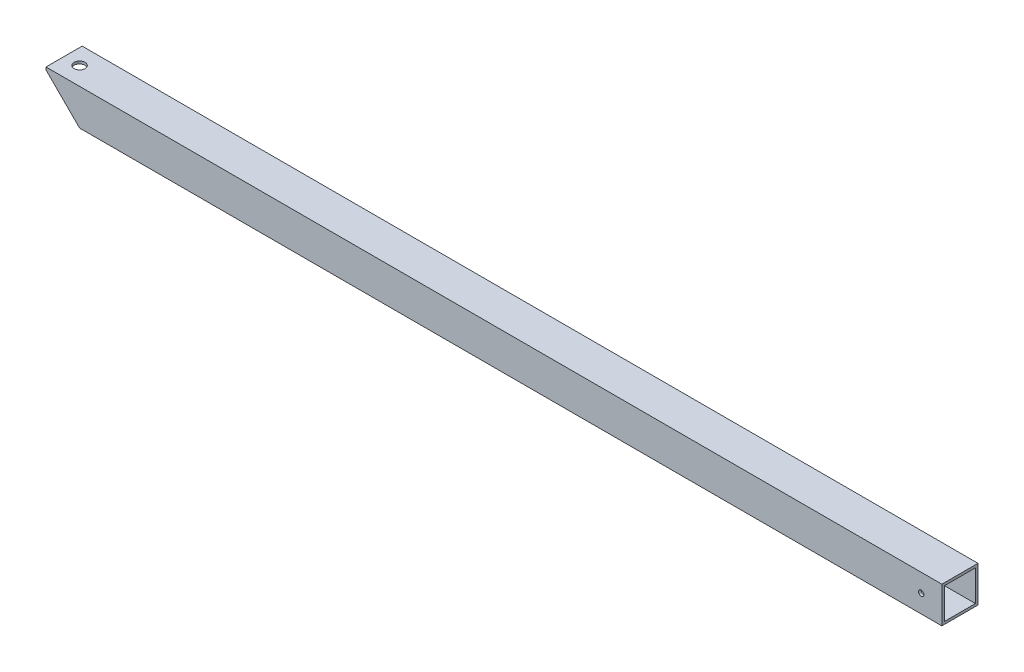
ISO-10303-21;
HEADER;
FILE_DESCRIPTION(('STEP AP214'),'2;1');
FILE_NAME('part.step','',(''),(''),'','','');
FILE_SCHEMA(('AUTOMOTIVE_DESIGN { 1 0 10303 214 1 1 1 1 }'));
ENDSEC;
DATA;
#1=APPLICATION_CONTEXT('core data for automotive mechanical design processes');
#2=APPLICATION_PROTOCOL_DEFINITION('international standard','automotive_design',2000,#1);
#3=PRODUCT_CONTEXT('',#1,'mechanical');
#4=PRODUCT('Part','Part','',(#3));
#5=PRODUCT_RELATED_PRODUCT_CATEGORY('part','',(#4));
#6=PRODUCT_DEFINITION_FORMATION('','',#4);
#7=PRODUCT_DEFINITION_CONTEXT('part definition',#1,'design');
#8=PRODUCT_DEFINITION('design','',#6,#7);
#9=PRODUCT_DEFINITION_SHAPE('','',#8);
#10=(LENGTH_UNIT() NAMED_UNIT(*) SI_UNIT(.MILLI.,.METRE.));
#11=(NAMED_UNIT(*) PLANE_ANGLE_UNIT() SI_UNIT($,.RADIAN.));
#12=(NAMED_UNIT(*) SI_UNIT($,.STERADIAN.) SOLID_ANGLE_UNIT());
#13=UNCERTAINTY_MEASURE_WITH_UNIT(LENGTH_MEASURE(1.E-05),#10,'distance_accuracy_value','');
#14=(GEOMETRIC_REPRESENTATION_CONTEXT(3) GLOBAL_UNCERTAINTY_ASSIGNED_CONTEXT((#13)) GLOBAL_UNIT_ASSIGNED_CONTEXT((#10,
#11,#12)) REPRESENTATION_CONTEXT('',''));
#15=CARTESIAN_POINT('',(0.,0.,0.));
#16=DIRECTION('',(0.,0.,1.));
#17=DIRECTION('',(1.,0.,0.));
#18=AXIS2_PLACEMENT_3D('',#15,#16,#17);
#19=CARTESIAN_POINT('',(0.,-3.175,22.225));
#20=DIRECTION('',(0.707106781186549,0.707106781186546,0.));
#21=DIRECTION('',(-0.707106781186546,0.707106781186549,0.));
#22=AXIS2_PLACEMENT_3D('',#19,#20,#21);
#23=PLANE('',#22);
#24=DIRECTION('',(0.707106781186546,-0.707106781186549,0.));
#25=VECTOR('',#24,1.);
#26=CARTESIAN_POINT('',(0.,-3.175,-19.05));
#27=LINE('',#26,#25);
#28=CARTESIAN_POINT('',(0.,-3.175,-19.05));
#29=VERTEX_POINT('',#28);
#30=CARTESIAN_POINT('',(38.0999999999999,-41.275,-19.05));
#31=VERTEX_POINT('',#30);
#32=EDGE_CURVE('E111',#29,#31,#27,.T.);
#33=ORIENTED_EDGE('',*,*,#32,.F.);
#34=DIRECTION('',(0.,0.,-1.));
#35=VECTOR('',#34,1.);
#36=CARTESIAN_POINT('',(0.,-3.175,22.225));
#37=LINE('',#36,#35);
#38=CARTESIAN_POINT('',(0.,-3.175,-22.225));
#39=VERTEX_POINT('',#38);
#40=EDGE_CURVE('E43',#29,#39,#37,.T.);
#41=ORIENTED_EDGE('',*,*,#40,.T.);
#42=DIRECTION('',(0.707106781186546,-0.707106781186549,0.));
#43=VECTOR('',#42,1.);
#44=CARTESIAN_POINT('',(0.,-3.175,-22.225));
#45=LINE('',#44,#43);
#46=CARTESIAN_POINT('',(41.2749999999998,-44.45,-22.225));
#47=VERTEX_POINT('',#46);
#48=EDGE_CURVE('E158',#39,#47,#45,.T.);
#49=ORIENTED_EDGE('',*,*,#48,.T.);
#50=DIRECTION('',(0.,0.,-1.));
#51=VECTOR('',#50,1.);
#52=CARTESIAN_POINT('',(41.2749999999998,-44.45,22.225));
#53=LINE('',#52,#51);
#54=CARTESIAN_POINT('',(41.2749999999998,-44.45,22.225));
#55=VERTEX_POINT('',#54);
#56=EDGE_CURVE('E138',#55,#47,#53,.T.);
#57=ORIENTED_EDGE('',*,*,#56,.F.);
#58=DIRECTION('',(0.707106781186546,-0.707106781186549,0.));
#59=VECTOR('',#58,1.);
#60=CARTESIAN_POINT('',(0.,-3.175,22.225));
#61=LINE('',#60,#59);
#62=CARTESIAN_POINT('',(0.,-3.175,22.225));
#63=VERTEX_POINT('',#62);
#64=EDGE_CURVE('E167',#63,#55,#61,.T.);
#65=ORIENTED_EDGE('',*,*,#64,.F.);
#66=CARTESIAN_POINT('',(0.,-3.175,19.05));
#67=VERTEX_POINT('',#66);
#68=EDGE_CURVE('E11',#63,#67,#37,.T.);
#69=ORIENTED_EDGE('',*,*,#68,.T.);
#70=DIRECTION('',(0.707106781186546,-0.707106781186549,0.));
#71=VECTOR('',#70,1.);
#72=CARTESIAN_POINT('',(0.,-3.175,19.05));
#73=LINE('',#72,#71);
#74=CARTESIAN_POINT('',(38.0999999999999,-41.275,19.05));
#75=VERTEX_POINT('',#74);
#76=EDGE_CURVE('E116',#67,#75,#73,.T.);
#77=ORIENTED_EDGE('',*,*,#76,.T.);
#78=DIRECTION('',(0.,0.,-1.));
#79=VECTOR('',#78,1.);
#80=CARTESIAN_POINT('',(38.0999999999999,-41.275,22.225));
#81=LINE('',#80,#79);
#82=EDGE_CURVE('E125',#75,#31,#81,.T.);
#83=ORIENTED_EDGE('',*,*,#82,.T.);
#84=EDGE_LOOP('',(#33,#41,#49,#57,#65,#69,#77,#83));
#85=FACE_BOUND('',#84,.T.);
#86=ADVANCED_FACE('F34',(#85),#23,.F.);
#87=CARTESIAN_POINT('',(1101.725,-44.45,22.225));
#88=DIRECTION('',(-1.,0.,0.));
#89=DIRECTION('',(0.,-1.,0.));
#90=AXIS2_PLACEMENT_3D('',#87,#88,#89);
#91=PLANE('',#90);
#92=DIRECTION('',(0.,1.,0.));
#93=VECTOR('',#92,1.);
#94=CARTESIAN_POINT('',(1101.725,-44.45,-22.225));
#95=LINE('',#94,#93);
#96=CARTESIAN_POINT('',(1101.725,-44.45,-22.225));
#97=VERTEX_POINT('',#96);
#98=CARTESIAN_POINT('',(1101.725,0.,-22.225));
#99=VERTEX_POINT('',#98);
#100=EDGE_CURVE('E154',#97,#99,#95,.T.);
#101=ORIENTED_EDGE('',*,*,#100,.T.);
#102=DIRECTION('',(0.,0.,-1.));
#103=VECTOR('',#102,1.);
#104=CARTESIAN_POINT('',(1101.725,0.,22.225));
#105=LINE('',#104,#103);
#106=CARTESIAN_POINT('',(1101.725,0.,22.225));
#107=VERTEX_POINT('',#106);
#108=EDGE_CURVE('E145',#107,#99,#105,.T.);
#109=ORIENTED_EDGE('',*,*,#108,.F.);
#110=DIRECTION('',(0.,1.,0.));
#111=VECTOR('',#110,1.);
#112=CARTESIAN_POINT('',(1101.725,-44.45,22.225));
#113=LINE('',#112,#111);
#114=CARTESIAN_POINT('',(1101.725,-44.45,22.225));
#115=VERTEX_POINT('',#114);
#116=EDGE_CURVE('E163',#115,#107,#113,.T.);
#117=ORIENTED_EDGE('',*,*,#116,.F.);
#118=DIRECTION('',(0.,0.,-1.));
#119=VECTOR('',#118,1.);
#120=CARTESIAN_POINT('',(1101.725,-44.45,22.225));
#121=LINE('',#120,#119);
#122=EDGE_CURVE('E140',#115,#97,#121,.T.);
#123=ORIENTED_EDGE('',*,*,#122,.T.);
#124=EDGE_LOOP('',(#101,#109,#117,#123));
#125=FACE_BOUND('',#124,.T.);
#126=DIRECTION('',(0.,1.,0.));
#127=VECTOR('',#126,1.);
#128=CARTESIAN_POINT('',(1101.725,-44.45,-19.05));
#129=LINE('',#128,#127);
#130=CARTESIAN_POINT('',(1101.725,-41.275,-19.05));
#131=VERTEX_POINT('',#130);
#132=CARTESIAN_POINT('',(1101.725,-3.175,-19.05));
#133=VERTEX_POINT('',#132);
#134=EDGE_CURVE('E114',#131,#133,#129,.T.);
#135=ORIENTED_EDGE('',*,*,#134,.F.);
#136=DIRECTION('',(0.,0.,-1.));
#137=VECTOR('',#136,1.);
#138=CARTESIAN_POINT('',(1101.725,-41.275,22.225));
#139=LINE('',#138,#137);
#140=CARTESIAN_POINT('',(1101.725,-41.275,19.05));
#141=VERTEX_POINT('',#140);
#142=EDGE_CURVE('E182',#141,#131,#139,.T.);
#143=ORIENTED_EDGE('',*,*,#142,.F.);
#144=DIRECTION('',(0.,1.,0.));
#145=VECTOR('',#144,1.);
#146=CARTESIAN_POINT('',(1101.725,-44.45,19.05));
#147=LINE('',#146,#145);
#148=CARTESIAN_POINT('',(1101.725,-3.175,19.05));
#149=VERTEX_POINT('',#148);
#150=EDGE_CURVE('E50',#141,#149,#147,.T.);
#151=ORIENTED_EDGE('',*,*,#150,.T.);
#152=DIRECTION('',(0.,0.,-1.));
#153=VECTOR('',#152,1.);
#154=CARTESIAN_POINT('',(1101.725,-3.175,22.225));
#155=LINE('',#154,#153);
#156=EDGE_CURVE('E180',#149,#133,#155,.T.);
#157=ORIENTED_EDGE('',*,*,#156,.T.);
#158=EDGE_LOOP('',(#135,#143,#151,#157));
#159=FACE_BOUND('',#158,.T.);
#160=ADVANCED_FACE('F214',(#125,#159),#91,.F.);
#161=CARTESIAN_POINT('',(1076.325,-22.225,22.225));
#162=DIRECTION('',(0.,0.,-1.));
#163=DIRECTION('',(-1.,0.,0.));
#164=AXIS2_PLACEMENT_3D('',#161,#162,#163);
#165=CYLINDRICAL_SURFACE('',#164,3.31470000000001);
#166=CARTESIAN_POINT('',(1076.325,-22.225,-22.225));
#167=DIRECTION('',(0.,0.,1.));
#168=DIRECTION('',(1.,0.,0.));
#169=AXIS2_PLACEMENT_3D('',#166,#167,#168);
#170=CIRCLE('',#169,3.31470000000001);
#171=CARTESIAN_POINT('',(1079.6397,-22.225,-22.225));
#172=VERTEX_POINT('',#171);
#173=EDGE_CURVE('E124',#172,#172,#170,.T.);
#174=ORIENTED_EDGE('',*,*,#173,.F.);
#175=EDGE_LOOP('',(#174));
#176=FACE_BOUND('',#175,.T.);
#177=CARTESIAN_POINT('',(1076.325,-22.225,-19.05));
#178=DIRECTION('',(0.,0.,1.));
#179=DIRECTION('',(1.,0.,0.));
#180=AXIS2_PLACEMENT_3D('',#177,#178,#179);
#181=CIRCLE('',#180,3.31470000000001);
#182=CARTESIAN_POINT('',(1079.6397,-22.225,-19.05));
#183=VERTEX_POINT('',#182);
#184=EDGE_CURVE('E175',#183,#183,#181,.T.);
#185=ORIENTED_EDGE('',*,*,#184,.T.);
#186=EDGE_LOOP('',(#185));
#187=FACE_BOUND('',#186,.T.);
#188=ADVANCED_FACE('F218',(#176,#187),#165,.F.);
#189=CARTESIAN_POINT('',(0.,0.,22.225));
#190=DIRECTION('',(0.,0.,1.));
#191=DIRECTION('',(1.,0.,0.));
#192=AXIS2_PLACEMENT_3D('',#189,#190,#191);
#193=PLANE('',#192);
#194=DIRECTION('',(0.,-1.,0.));
#195=VECTOR('',#194,1.);
#196=CARTESIAN_POINT('',(0.,0.,22.225));
#197=LINE('',#196,#195);
#198=CARTESIAN_POINT('',(0.,0.,22.225));
#199=VERTEX_POINT('',#198);
#200=EDGE_CURVE('E153',#199,#63,#197,.T.);
#201=ORIENTED_EDGE('',*,*,#200,.T.);
#202=ORIENTED_EDGE('',*,*,#64,.T.);
#203=DIRECTION('',(1.,0.,0.));
#204=VECTOR('',#203,1.);
#205=CARTESIAN_POINT('',(41.2749999999998,-44.45,22.225));
#206=LINE('',#205,#204);
#207=EDGE_CURVE('E165',#55,#115,#206,.T.);
#208=ORIENTED_EDGE('',*,*,#207,.T.);
#209=ORIENTED_EDGE('',*,*,#116,.T.);
#210=DIRECTION('',(-1.,0.,0.));
#211=VECTOR('',#210,1.);
#212=CARTESIAN_POINT('',(1101.725,0.,22.225));
#213=LINE('',#212,#211);
#214=EDGE_CURVE('E150',#107,#199,#213,.T.);
#215=ORIENTED_EDGE('',*,*,#214,.T.);
#216=EDGE_LOOP('',(#201,#202,#208,#209,#215));
#217=FACE_BOUND('',#216,.T.);
#218=CARTESIAN_POINT('',(1076.325,-22.225,22.225));
#219=DIRECTION('',(0.,0.,1.));
#220=DIRECTION('',(1.,0.,0.));
#221=AXIS2_PLACEMENT_3D('',#218,#219,#220);
#222=CIRCLE('',#221,3.31470000000001);
#223=CARTESIAN_POINT('',(1079.6397,-22.225,22.225));
#224=VERTEX_POINT('',#223);
#225=EDGE_CURVE('E161',#224,#224,#222,.T.);
#226=ORIENTED_EDGE('',*,*,#225,.F.);
#227=EDGE_LOOP('',(#226));
#228=FACE_BOUND('',#227,.T.);
#229=ADVANCED_FACE('F234',(#217,#228),#193,.T.);
#230=CARTESIAN_POINT('',(0.,0.,-22.225));
#231=DIRECTION('',(0.,0.,1.));
#232=DIRECTION('',(1.,0.,0.));
#233=AXIS2_PLACEMENT_3D('',#230,#231,#232);
#234=PLANE('',#233);
#235=DIRECTION('',(0.,-1.,0.));
#236=VECTOR('',#235,1.);
#237=CARTESIAN_POINT('',(0.,0.,-22.225));
#238=LINE('',#237,#236);
#239=CARTESIAN_POINT('',(0.,0.,-22.225));
#240=VERTEX_POINT('',#239);
#241=EDGE_CURVE('E137',#240,#39,#238,.T.);
#242=ORIENTED_EDGE('',*,*,#241,.F.);
#243=DIRECTION('',(-1.,0.,0.));
#244=VECTOR('',#243,1.);
#245=CARTESIAN_POINT('',(1101.725,0.,-22.225));
#246=LINE('',#245,#244);
#247=EDGE_CURVE('E151',#99,#240,#246,.T.);
#248=ORIENTED_EDGE('',*,*,#247,.F.);
#249=ORIENTED_EDGE('',*,*,#100,.F.);
#250=DIRECTION('',(1.,0.,0.));
#251=VECTOR('',#250,1.);
#252=CARTESIAN_POINT('',(41.2749999999998,-44.45,-22.225));
#253=LINE('',#252,#251);
#254=EDGE_CURVE('E156',#47,#97,#253,.T.);
#255=ORIENTED_EDGE('',*,*,#254,.F.);
#256=ORIENTED_EDGE('',*,*,#48,.F.);
#257=EDGE_LOOP('',(#242,#248,#249,#255,#256));
#258=FACE_BOUND('',#257,.T.);
#259=ORIENTED_EDGE('',*,*,#173,.T.);
#260=EDGE_LOOP('',(#259));
#261=FACE_BOUND('',#260,.T.);
#262=ADVANCED_FACE('F231',(#258,#261),#234,.F.);
#263=CARTESIAN_POINT('',(0.,0.,22.225));
#264=DIRECTION('',(1.,0.,0.));
#265=DIRECTION('',(0.,1.,0.));
#266=AXIS2_PLACEMENT_3D('',#263,#264,#265);
#267=PLANE('',#266);
#268=ORIENTED_EDGE('',*,*,#241,.T.);
#269=ORIENTED_EDGE('',*,*,#40,.F.);
#270=DIRECTION('',(0.,0.,-1.));
#271=VECTOR('',#270,1.);
#272=CARTESIAN_POINT('',(0.,-3.175,22.225));
#273=LINE('',#272,#271);
#274=EDGE_CURVE('E119',#67,#29,#273,.T.);
#275=ORIENTED_EDGE('',*,*,#274,.F.);
#276=ORIENTED_EDGE('',*,*,#68,.F.);
#277=ORIENTED_EDGE('',*,*,#200,.F.);
#278=DIRECTION('',(0.,0.,-1.));
#279=VECTOR('',#278,1.);
#280=CARTESIAN_POINT('',(0.,0.,22.225));
#281=LINE('',#280,#279);
#282=EDGE_CURVE('E148',#199,#240,#281,.T.);
#283=ORIENTED_EDGE('',*,*,#282,.T.);
#284=EDGE_LOOP('',(#268,#269,#275,#276,#277,#283));
#285=FACE_BOUND('',#284,.T.);
#286=ADVANCED_FACE('F36',(#285),#267,.F.);
#287=CARTESIAN_POINT('',(41.2749999999998,-44.45,22.225));
#288=DIRECTION('',(0.,1.,0.));
#289=DIRECTION('',(0.,0.,1.));
#290=AXIS2_PLACEMENT_3D('',#287,#288,#289);
#291=PLANE('',#290);
#292=ORIENTED_EDGE('',*,*,#254,.T.);
#293=ORIENTED_EDGE('',*,*,#122,.F.);
#294=ORIENTED_EDGE('',*,*,#207,.F.);
#295=ORIENTED_EDGE('',*,*,#56,.T.);
#296=EDGE_LOOP('',(#292,#293,#294,#295));
#297=FACE_BOUND('',#296,.T.);
#298=ADVANCED_FACE('F222',(#297),#291,.F.);
#299=CARTESIAN_POINT('',(1101.725,0.,22.225));
#300=DIRECTION('',(0.,-1.,0.));
#301=DIRECTION('',(0.,0.,-1.));
#302=AXIS2_PLACEMENT_3D('',#299,#300,#301);
#303=PLANE('',#302);
#304=CARTESIAN_POINT('',(19.05,0.,0.));
#305=DIRECTION('',(0.,1.,0.));
#306=DIRECTION('',(0.,0.,1.));
#307=AXIS2_PLACEMENT_3D('',#304,#305,#306);
#308=CIRCLE('',#307,6.74623999999996);
#309=CARTESIAN_POINT('',(19.05,0.,6.74623999999996));
#310=VERTEX_POINT('',#309);
#311=EDGE_CURVE('E193',#310,#310,#308,.T.);
#312=ORIENTED_EDGE('',*,*,#311,.F.);
#313=EDGE_LOOP('',(#312));
#314=FACE_BOUND('',#313,.T.);
#315=ORIENTED_EDGE('',*,*,#247,.T.);
#316=ORIENTED_EDGE('',*,*,#282,.F.);
#317=ORIENTED_EDGE('',*,*,#214,.F.);
#318=ORIENTED_EDGE('',*,*,#108,.T.);
#319=EDGE_LOOP('',(#315,#316,#317,#318));
#320=FACE_BOUND('',#319,.T.);
#321=ADVANCED_FACE('F224',(#314,#320),#303,.F.);
#322=CARTESIAN_POINT('',(1076.325,-22.225,19.05));
#323=DIRECTION('',(0.,0.,1.));
#324=DIRECTION('',(1.,0.,0.));
#325=AXIS2_PLACEMENT_3D('',#322,#323,#324);
#326=CIRCLE('',#325,3.31470000000001);
#327=CARTESIAN_POINT('',(1079.6397,-22.225,19.05));
#328=VERTEX_POINT('',#327);
#329=EDGE_CURVE('E132',#328,#328,#326,.T.);
#330=ORIENTED_EDGE('',*,*,#329,.F.);
#331=EDGE_LOOP('',(#330));
#332=FACE_BOUND('',#331,.T.);
#333=ORIENTED_EDGE('',*,*,#225,.T.);
#334=EDGE_LOOP('',(#333));
#335=FACE_BOUND('',#334,.T.);
#336=ADVANCED_FACE('F229',(#332,#335),#165,.F.);
#337=CARTESIAN_POINT('',(0.,0.,19.05));
#338=DIRECTION('',(0.,0.,1.));
#339=DIRECTION('',(1.,0.,0.));
#340=AXIS2_PLACEMENT_3D('',#337,#338,#339);
#341=PLANE('',#340);
#342=DIRECTION('',(-1.,0.,0.));
#343=VECTOR('',#342,1.);
#344=CARTESIAN_POINT('',(1101.725,-3.175,19.05));
#345=LINE('',#344,#343);
#346=EDGE_CURVE('E57',#149,#67,#345,.T.);
#347=ORIENTED_EDGE('',*,*,#346,.F.);
#348=ORIENTED_EDGE('',*,*,#150,.F.);
#349=DIRECTION('',(1.,0.,0.));
#350=VECTOR('',#349,1.);
#351=CARTESIAN_POINT('',(41.2749999999998,-41.275,19.05));
#352=LINE('',#351,#350);
#353=EDGE_CURVE('E187',#75,#141,#352,.T.);
#354=ORIENTED_EDGE('',*,*,#353,.F.);
#355=ORIENTED_EDGE('',*,*,#76,.F.);
#356=EDGE_LOOP('',(#347,#348,#354,#355));
#357=FACE_BOUND('',#356,.T.);
#358=ORIENTED_EDGE('',*,*,#329,.T.);
#359=EDGE_LOOP('',(#358));
#360=FACE_BOUND('',#359,.T.);
#361=ADVANCED_FACE('F239',(#357,#360),#341,.F.);
#362=CARTESIAN_POINT('',(0.,0.,-19.05));
#363=DIRECTION('',(0.,0.,1.));
#364=DIRECTION('',(1.,0.,0.));
#365=AXIS2_PLACEMENT_3D('',#362,#363,#364);
#366=PLANE('',#365);
#367=ORIENTED_EDGE('',*,*,#32,.T.);
#368=DIRECTION('',(1.,0.,0.));
#369=VECTOR('',#368,1.);
#370=CARTESIAN_POINT('',(41.2749999999998,-41.275,-19.05));
#371=LINE('',#370,#369);
#372=EDGE_CURVE('E131',#31,#131,#371,.T.);
#373=ORIENTED_EDGE('',*,*,#372,.T.);
#374=ORIENTED_EDGE('',*,*,#134,.T.);
#375=DIRECTION('',(-1.,0.,0.));
#376=VECTOR('',#375,1.);
#377=CARTESIAN_POINT('',(1101.725,-3.175,-19.05));
#378=LINE('',#377,#376);
#379=EDGE_CURVE('E107',#133,#29,#378,.T.);
#380=ORIENTED_EDGE('',*,*,#379,.T.);
#381=EDGE_LOOP('',(#367,#373,#374,#380));
#382=FACE_BOUND('',#381,.T.);
#383=ORIENTED_EDGE('',*,*,#184,.F.);
#384=EDGE_LOOP('',(#383));
#385=FACE_BOUND('',#384,.T.);
#386=ADVANCED_FACE('F108',(#382,#385),#366,.T.);
#387=CARTESIAN_POINT('',(41.2749999999998,-41.275,22.225));
#388=DIRECTION('',(0.,1.,0.));
#389=DIRECTION('',(0.,0.,1.));
#390=AXIS2_PLACEMENT_3D('',#387,#388,#389);
#391=PLANE('',#390);
#392=ORIENTED_EDGE('',*,*,#372,.F.);
#393=ORIENTED_EDGE('',*,*,#82,.F.);
#394=ORIENTED_EDGE('',*,*,#353,.T.);
#395=ORIENTED_EDGE('',*,*,#142,.T.);
#396=EDGE_LOOP('',(#392,#393,#394,#395));
#397=FACE_BOUND('',#396,.T.);
#398=ADVANCED_FACE('F203',(#397),#391,.T.);
#399=CARTESIAN_POINT('',(1101.725,-3.175,22.225));
#400=DIRECTION('',(0.,-1.,0.));
#401=DIRECTION('',(0.,0.,-1.));
#402=AXIS2_PLACEMENT_3D('',#399,#400,#401);
#403=PLANE('',#402);
#404=CARTESIAN_POINT('',(19.05,-3.175,0.));
#405=DIRECTION('',(0.,-1.,0.));
#406=DIRECTION('',(0.,0.,-1.));
#407=AXIS2_PLACEMENT_3D('',#404,#405,#406);
#408=CIRCLE('',#407,6.74623999999998);
#409=CARTESIAN_POINT('',(19.05,-3.175,-6.74623999999998));
#410=VERTEX_POINT('',#409);
#411=EDGE_CURVE('E38',#410,#410,#408,.T.);
#412=ORIENTED_EDGE('',*,*,#411,.F.);
#413=EDGE_LOOP('',(#412));
#414=FACE_BOUND('',#413,.T.);
#415=ORIENTED_EDGE('',*,*,#379,.F.);
#416=ORIENTED_EDGE('',*,*,#156,.F.);
#417=ORIENTED_EDGE('',*,*,#346,.T.);
#418=ORIENTED_EDGE('',*,*,#274,.T.);
#419=EDGE_LOOP('',(#415,#416,#417,#418));
#420=FACE_BOUND('',#419,.T.);
#421=ADVANCED_FACE('F120',(#414,#420),#403,.T.);
#422=CARTESIAN_POINT('',(19.05,0.,0.));
#423=DIRECTION('',(0.,1.,0.));
#424=DIRECTION('',(0.,0.,1.));
#425=AXIS2_PLACEMENT_3D('',#422,#423,#424);
#426=CYLINDRICAL_SURFACE('',#425,6.74623999999998);
#427=ORIENTED_EDGE('',*,*,#411,.T.);
#428=EDGE_LOOP('',(#427));
#429=FACE_BOUND('',#428,.T.);
#430=ORIENTED_EDGE('',*,*,#311,.T.);
#431=EDGE_LOOP('',(#430));
#432=FACE_BOUND('',#431,.T.);
#433=ADVANCED_FACE('F200',(#429,#432),#426,.F.);
#434=CLOSED_SHELL('',(#86,#160,#188,#229,#262,#286,#298,#321,#336,#361,#386,#398,#421,#433));
#435=MANIFOLD_SOLID_BREP('B2',#434);
#436=ADVANCED_BREP_SHAPE_REPRESENTATION('',(#18,#435),#14);
#437=SHAPE_DEFINITION_REPRESENTATION(#9,#436);
ENDSEC;
END-ISO-10303-21;
